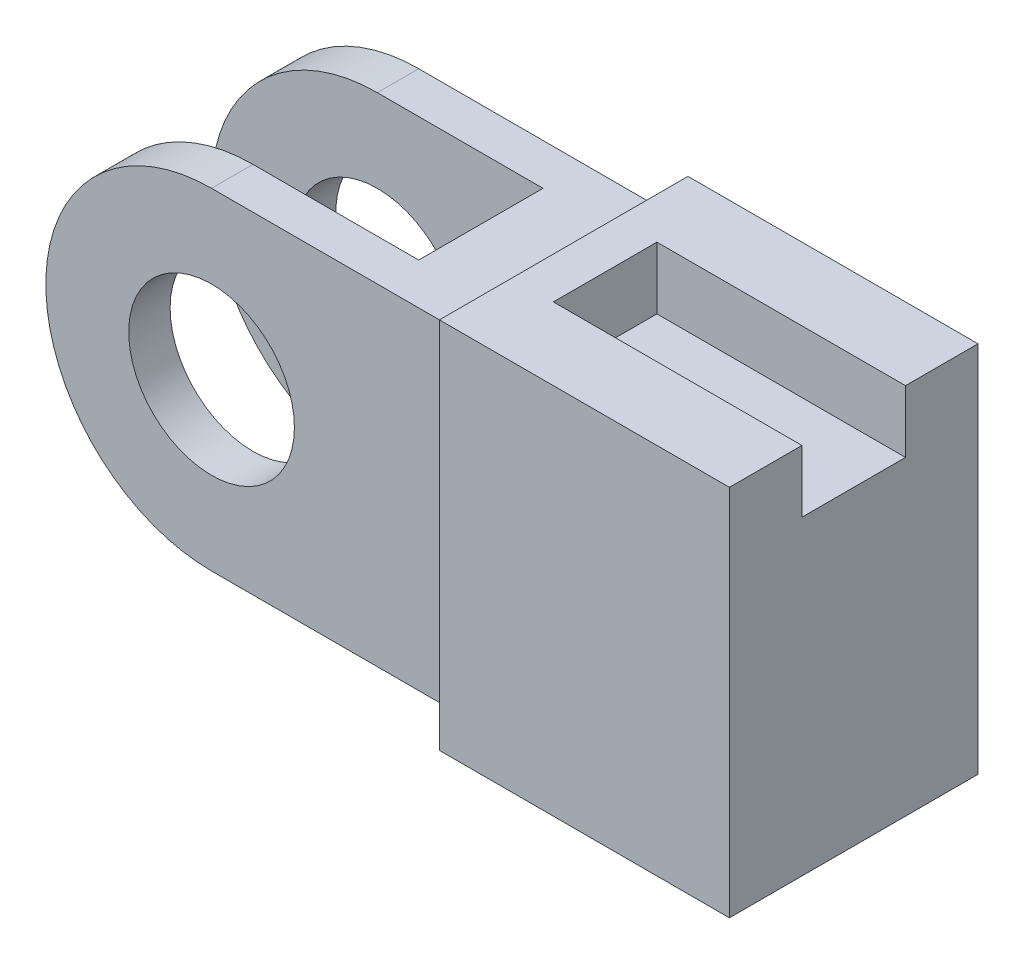
ISO-10303-21;
HEADER;
FILE_DESCRIPTION(('STEP AP214'),'2;1');
FILE_NAME('part.step','',(''),(''),'','','');
FILE_SCHEMA(('AUTOMOTIVE_DESIGN { 1 0 10303 214 1 1 1 1 }'));
ENDSEC;
DATA;
#1=APPLICATION_CONTEXT('core data for automotive mechanical design processes');
#2=APPLICATION_PROTOCOL_DEFINITION('international standard','automotive_design',2000,#1);
#3=PRODUCT_CONTEXT('',#1,'mechanical');
#4=PRODUCT('Part','Part','',(#3));
#5=PRODUCT_RELATED_PRODUCT_CATEGORY('part','',(#4));
#6=PRODUCT_DEFINITION_FORMATION('','',#4);
#7=PRODUCT_DEFINITION_CONTEXT('part definition',#1,'design');
#8=PRODUCT_DEFINITION('design','',#6,#7);
#9=PRODUCT_DEFINITION_SHAPE('','',#8);
#10=(LENGTH_UNIT() NAMED_UNIT(*) SI_UNIT(.MILLI.,.METRE.));
#11=(NAMED_UNIT(*) PLANE_ANGLE_UNIT() SI_UNIT($,.RADIAN.));
#12=(NAMED_UNIT(*) SI_UNIT($,.STERADIAN.) SOLID_ANGLE_UNIT());
#13=UNCERTAINTY_MEASURE_WITH_UNIT(LENGTH_MEASURE(1.E-05),#10,'distance_accuracy_value','');
#14=(GEOMETRIC_REPRESENTATION_CONTEXT(3) GLOBAL_UNCERTAINTY_ASSIGNED_CONTEXT((#13)) GLOBAL_UNIT_ASSIGNED_CONTEXT((#10,
#11,#12)) REPRESENTATION_CONTEXT('',''));
#15=CARTESIAN_POINT('',(0.,0.,0.));
#16=DIRECTION('',(0.,0.,1.));
#17=DIRECTION('',(1.,0.,0.));
#18=AXIS2_PLACEMENT_3D('',#15,#16,#17);
#19=CARTESIAN_POINT('',(-60.,40.,25.));
#20=DIRECTION('',(0.,0.,-1.));
#21=DIRECTION('',(-1.,0.,0.));
#22=AXIS2_PLACEMENT_3D('',#19,#20,#21);
#23=CYLINDRICAL_SURFACE('',#22,40.);
#24=CARTESIAN_POINT('',(-60.,40.,15.));
#25=DIRECTION('',(0.,0.,-1.));
#26=DIRECTION('',(-1.,0.,0.));
#27=AXIS2_PLACEMENT_3D('',#24,#25,#26);
#28=CIRCLE('',#27,40.);
#29=CARTESIAN_POINT('',(-60.,0.,15.));
#30=VERTEX_POINT('',#29);
#31=CARTESIAN_POINT('',(-60.,80.,15.));
#32=VERTEX_POINT('',#31);
#33=EDGE_CURVE('E254',#30,#32,#28,.T.);
#34=ORIENTED_EDGE('',*,*,#33,.F.);
#35=DIRECTION('',(0.,0.,-1.));
#36=VECTOR('',#35,1.);
#37=CARTESIAN_POINT('',(-60.,0.,25.));
#38=LINE('',#37,#36);
#39=CARTESIAN_POINT('',(-60.,0.,25.));
#40=VERTEX_POINT('',#39);
#41=EDGE_CURVE('E293',#40,#30,#38,.T.);
#42=ORIENTED_EDGE('',*,*,#41,.F.);
#43=CARTESIAN_POINT('',(-60.,40.,25.));
#44=DIRECTION('',(0.,0.,1.));
#45=DIRECTION('',(1.,0.,0.));
#46=AXIS2_PLACEMENT_3D('',#43,#44,#45);
#47=CIRCLE('',#46,40.);
#48=CARTESIAN_POINT('',(-60.,80.,25.));
#49=VERTEX_POINT('',#48);
#50=EDGE_CURVE('E268',#49,#40,#47,.T.);
#51=ORIENTED_EDGE('',*,*,#50,.F.);
#52=DIRECTION('',(0.,0.,-1.));
#53=VECTOR('',#52,1.);
#54=CARTESIAN_POINT('',(-60.,80.,25.));
#55=LINE('',#54,#53);
#56=EDGE_CURVE('E13',#49,#32,#55,.T.);
#57=ORIENTED_EDGE('',*,*,#56,.T.);
#58=EDGE_LOOP('',(#34,#42,#51,#57));
#59=FACE_BOUND('',#58,.T.);
#60=ADVANCED_FACE('F47',(#59),#23,.T.);
#61=CARTESIAN_POINT('',(-60.,40.,-25.));
#62=DIRECTION('',(0.,0.,1.));
#63=DIRECTION('',(1.,0.,0.));
#64=AXIS2_PLACEMENT_3D('',#61,#62,#63);
#65=CYLINDRICAL_SURFACE('',#64,20.);
#66=CARTESIAN_POINT('',(-60.,40.,25.));
#67=DIRECTION('',(0.,0.,1.));
#68=DIRECTION('',(1.,0.,0.));
#69=AXIS2_PLACEMENT_3D('',#66,#67,#68);
#70=CIRCLE('',#69,20.);
#71=CARTESIAN_POINT('',(-40.,40.,25.));
#72=VERTEX_POINT('',#71);
#73=EDGE_CURVE('E258',#72,#72,#70,.T.);
#74=ORIENTED_EDGE('',*,*,#73,.T.);
#75=EDGE_LOOP('',(#74));
#76=FACE_BOUND('',#75,.T.);
#77=CARTESIAN_POINT('',(-60.,40.,15.));
#78=DIRECTION('',(0.,0.,-1.));
#79=DIRECTION('',(-1.,0.,0.));
#80=AXIS2_PLACEMENT_3D('',#77,#78,#79);
#81=CIRCLE('',#80,20.);
#82=CARTESIAN_POINT('',(-80.,40.,15.));
#83=VERTEX_POINT('',#82);
#84=EDGE_CURVE('E251',#83,#83,#81,.F.);
#85=ORIENTED_EDGE('',*,*,#84,.F.);
#86=EDGE_LOOP('',(#85));
#87=FACE_BOUND('',#86,.T.);
#88=ADVANCED_FACE('F300',(#76,#87),#65,.F.);
#89=CARTESIAN_POINT('',(0.,80.,25.));
#90=DIRECTION('',(0.,-1.,0.));
#91=DIRECTION('',(1.,0.,0.));
#92=AXIS2_PLACEMENT_3D('',#89,#90,#91);
#93=PLANE('',#92);
#94=CARTESIAN_POINT('',(-60.,80.,-15.));
#95=VERTEX_POINT('',#94);
#96=CARTESIAN_POINT('',(-60.,80.,-25.));
#97=VERTEX_POINT('',#96);
#98=EDGE_CURVE('E56',#95,#97,#55,.T.);
#99=ORIENTED_EDGE('',*,*,#98,.F.);
#100=DIRECTION('',(-1.,0.,0.));
#101=VECTOR('',#100,1.);
#102=CARTESIAN_POINT('',(-20.,80.,-15.));
#103=LINE('',#102,#101);
#104=CARTESIAN_POINT('',(-20.,80.,-15.));
#105=VERTEX_POINT('',#104);
#106=EDGE_CURVE('E236',#105,#95,#103,.T.);
#107=ORIENTED_EDGE('',*,*,#106,.F.);
#108=DIRECTION('',(0.,0.,1.));
#109=VECTOR('',#108,1.);
#110=CARTESIAN_POINT('',(-20.,80.,-15.));
#111=LINE('',#110,#109);
#112=CARTESIAN_POINT('',(-20.,80.,15.));
#113=VERTEX_POINT('',#112);
#114=EDGE_CURVE('E242',#105,#113,#111,.T.);
#115=ORIENTED_EDGE('',*,*,#114,.T.);
#116=DIRECTION('',(-1.,0.,0.));
#117=VECTOR('',#116,1.);
#118=CARTESIAN_POINT('',(-20.,80.,15.));
#119=LINE('',#118,#117);
#120=EDGE_CURVE('E244',#113,#32,#119,.T.);
#121=ORIENTED_EDGE('',*,*,#120,.T.);
#122=ORIENTED_EDGE('',*,*,#56,.F.);
#123=DIRECTION('',(-1.,0.,0.));
#124=VECTOR('',#123,1.);
#125=CARTESIAN_POINT('',(0.,80.,25.));
#126=LINE('',#125,#124);
#127=CARTESIAN_POINT('',(0.,80.,25.));
#128=VERTEX_POINT('',#127);
#129=EDGE_CURVE('E265',#128,#49,#126,.T.);
#130=ORIENTED_EDGE('',*,*,#129,.F.);
#131=DIRECTION('',(0.,0.,-1.));
#132=VECTOR('',#131,1.);
#133=CARTESIAN_POINT('',(0.,80.,25.));
#134=LINE('',#133,#132);
#135=CARTESIAN_POINT('',(0.,80.,-25.));
#136=VERTEX_POINT('',#135);
#137=EDGE_CURVE('E276',#128,#136,#134,.T.);
#138=ORIENTED_EDGE('',*,*,#137,.T.);
#139=DIRECTION('',(-1.,0.,0.));
#140=VECTOR('',#139,1.);
#141=CARTESIAN_POINT('',(0.,80.,-25.));
#142=LINE('',#141,#140);
#143=EDGE_CURVE('E262',#136,#97,#142,.T.);
#144=ORIENTED_EDGE('',*,*,#143,.T.);
#145=EDGE_LOOP('',(#99,#107,#115,#121,#122,#130,#138,#144));
#146=FACE_BOUND('',#145,.T.);
#147=ADVANCED_FACE('F49',(#146),#93,.F.);
#148=CARTESIAN_POINT('',(-60.,40.,-15.));
#149=DIRECTION('',(0.,0.,-1.));
#150=DIRECTION('',(-1.,0.,0.));
#151=AXIS2_PLACEMENT_3D('',#148,#149,#150);
#152=CIRCLE('',#151,40.);
#153=CARTESIAN_POINT('',(-60.,0.,-15.));
#154=VERTEX_POINT('',#153);
#155=EDGE_CURVE('E256',#154,#95,#152,.T.);
#156=ORIENTED_EDGE('',*,*,#155,.T.);
#157=ORIENTED_EDGE('',*,*,#98,.T.);
#158=CARTESIAN_POINT('',(-60.,40.,-25.));
#159=DIRECTION('',(0.,0.,1.));
#160=DIRECTION('',(1.,0.,0.));
#161=AXIS2_PLACEMENT_3D('',#158,#159,#160);
#162=CIRCLE('',#161,40.);
#163=CARTESIAN_POINT('',(-60.,0.,-25.));
#164=VERTEX_POINT('',#163);
#165=EDGE_CURVE('E279',#97,#164,#162,.T.);
#166=ORIENTED_EDGE('',*,*,#165,.T.);
#167=EDGE_CURVE('E292',#154,#164,#38,.T.);
#168=ORIENTED_EDGE('',*,*,#167,.F.);
#169=EDGE_LOOP('',(#156,#157,#166,#168));
#170=FACE_BOUND('',#169,.T.);
#171=ADVANCED_FACE('F309',(#170),#23,.T.);
#172=CARTESIAN_POINT('',(0.,0.,25.));
#173=DIRECTION('',(0.,-1.,0.));
#174=DIRECTION('',(0.,0.,-1.));
#175=AXIS2_PLACEMENT_3D('',#172,#173,#174);
#176=PLANE('',#175);
#177=DIRECTION('',(1.,0.,0.));
#178=VECTOR('',#177,1.);
#179=CARTESIAN_POINT('',(-20.,0.,-15.));
#180=LINE('',#179,#178);
#181=CARTESIAN_POINT('',(-20.,0.,-15.));
#182=VERTEX_POINT('',#181);
#183=EDGE_CURVE('E240',#154,#182,#180,.T.);
#184=ORIENTED_EDGE('',*,*,#183,.F.);
#185=ORIENTED_EDGE('',*,*,#167,.T.);
#186=DIRECTION('',(-1.,0.,0.));
#187=VECTOR('',#186,1.);
#188=CARTESIAN_POINT('',(0.,0.,-25.));
#189=LINE('',#188,#187);
#190=CARTESIAN_POINT('',(0.,0.,-25.));
#191=VERTEX_POINT('',#190);
#192=EDGE_CURVE('E282',#191,#164,#189,.T.);
#193=ORIENTED_EDGE('',*,*,#192,.F.);
#194=DIRECTION('',(0.,0.,-1.));
#195=VECTOR('',#194,1.);
#196=CARTESIAN_POINT('',(0.,0.,25.));
#197=LINE('',#196,#195);
#198=CARTESIAN_POINT('',(0.,0.,25.));
#199=VERTEX_POINT('',#198);
#200=EDGE_CURVE('E289',#199,#191,#197,.T.);
#201=ORIENTED_EDGE('',*,*,#200,.F.);
#202=DIRECTION('',(-1.,0.,0.));
#203=VECTOR('',#202,1.);
#204=CARTESIAN_POINT('',(0.,0.,25.));
#205=LINE('',#204,#203);
#206=EDGE_CURVE('E271',#199,#40,#205,.T.);
#207=ORIENTED_EDGE('',*,*,#206,.T.);
#208=ORIENTED_EDGE('',*,*,#41,.T.);
#209=DIRECTION('',(1.,0.,0.));
#210=VECTOR('',#209,1.);
#211=CARTESIAN_POINT('',(-20.,0.,15.));
#212=LINE('',#211,#210);
#213=CARTESIAN_POINT('',(-20.,0.,15.));
#214=VERTEX_POINT('',#213);
#215=EDGE_CURVE('E237',#30,#214,#212,.T.);
#216=ORIENTED_EDGE('',*,*,#215,.T.);
#217=DIRECTION('',(0.,0.,1.));
#218=VECTOR('',#217,1.);
#219=CARTESIAN_POINT('',(-20.,0.,-15.));
#220=LINE('',#219,#218);
#221=EDGE_CURVE('E249',#182,#214,#220,.T.);
#222=ORIENTED_EDGE('',*,*,#221,.F.);
#223=EDGE_LOOP('',(#184,#185,#193,#201,#207,#208,#216,#222));
#224=FACE_BOUND('',#223,.T.);
#225=ADVANCED_FACE('F345',(#224),#176,.T.);
#226=CARTESIAN_POINT('',(0.,0.,25.));
#227=DIRECTION('',(0.,0.,1.));
#228=DIRECTION('',(1.,0.,0.));
#229=AXIS2_PLACEMENT_3D('',#226,#227,#228);
#230=PLANE('',#229);
#231=ORIENTED_EDGE('',*,*,#73,.F.);
#232=EDGE_LOOP('',(#231));
#233=FACE_BOUND('',#232,.T.);
#234=ORIENTED_EDGE('',*,*,#129,.T.);
#235=ORIENTED_EDGE('',*,*,#50,.T.);
#236=ORIENTED_EDGE('',*,*,#206,.F.);
#237=DIRECTION('',(0.,1.,0.));
#238=VECTOR('',#237,1.);
#239=CARTESIAN_POINT('',(0.,0.,25.));
#240=LINE('',#239,#238);
#241=EDGE_CURVE('E274',#199,#128,#240,.T.);
#242=ORIENTED_EDGE('',*,*,#241,.T.);
#243=EDGE_LOOP('',(#234,#235,#236,#242));
#244=FACE_BOUND('',#243,.T.);
#245=ADVANCED_FACE('F324',(#233,#244),#230,.T.);
#246=CARTESIAN_POINT('',(0.,0.,-25.));
#247=DIRECTION('',(0.,0.,1.));
#248=DIRECTION('',(1.,0.,0.));
#249=AXIS2_PLACEMENT_3D('',#246,#247,#248);
#250=PLANE('',#249);
#251=CARTESIAN_POINT('',(-60.,40.,-25.));
#252=DIRECTION('',(0.,0.,1.));
#253=DIRECTION('',(1.,0.,0.));
#254=AXIS2_PLACEMENT_3D('',#251,#252,#253);
#255=CIRCLE('',#254,20.);
#256=CARTESIAN_POINT('',(-40.,40.,-25.));
#257=VERTEX_POINT('',#256);
#258=EDGE_CURVE('E259',#257,#257,#255,.T.);
#259=ORIENTED_EDGE('',*,*,#258,.T.);
#260=EDGE_LOOP('',(#259));
#261=FACE_BOUND('',#260,.T.);
#262=ORIENTED_EDGE('',*,*,#143,.F.);
#263=DIRECTION('',(0.,1.,0.));
#264=VECTOR('',#263,1.);
#265=CARTESIAN_POINT('',(0.,0.,-25.));
#266=LINE('',#265,#264);
#267=EDGE_CURVE('E269',#191,#136,#266,.T.);
#268=ORIENTED_EDGE('',*,*,#267,.F.);
#269=ORIENTED_EDGE('',*,*,#192,.T.);
#270=ORIENTED_EDGE('',*,*,#165,.F.);
#271=EDGE_LOOP('',(#262,#268,#269,#270));
#272=FACE_BOUND('',#271,.T.);
#273=ADVANCED_FACE('F316',(#261,#272),#250,.F.);
#274=CARTESIAN_POINT('',(-60.,40.,-15.));
#275=DIRECTION('',(0.,0.,-1.));
#276=DIRECTION('',(-1.,0.,0.));
#277=AXIS2_PLACEMENT_3D('',#274,#275,#276);
#278=CIRCLE('',#277,20.);
#279=CARTESIAN_POINT('',(-80.,40.,-15.));
#280=VERTEX_POINT('',#279);
#281=EDGE_CURVE('E51',#280,#280,#278,.F.);
#282=ORIENTED_EDGE('',*,*,#281,.T.);
#283=EDGE_LOOP('',(#282));
#284=FACE_BOUND('',#283,.T.);
#285=ORIENTED_EDGE('',*,*,#258,.F.);
#286=EDGE_LOOP('',(#285));
#287=FACE_BOUND('',#286,.T.);
#288=ADVANCED_FACE('F304',(#284,#287),#65,.F.);
#289=CARTESIAN_POINT('',(0.,0.,-15.));
#290=DIRECTION('',(0.,0.,-1.));
#291=DIRECTION('',(-1.,0.,0.));
#292=AXIS2_PLACEMENT_3D('',#289,#290,#291);
#293=PLANE('',#292);
#294=ORIENTED_EDGE('',*,*,#281,.F.);
#295=EDGE_LOOP('',(#294));
#296=FACE_BOUND('',#295,.T.);
#297=ORIENTED_EDGE('',*,*,#155,.F.);
#298=ORIENTED_EDGE('',*,*,#183,.T.);
#299=DIRECTION('',(0.,1.,0.));
#300=VECTOR('',#299,1.);
#301=CARTESIAN_POINT('',(-20.,80.,-15.));
#302=LINE('',#301,#300);
#303=EDGE_CURVE('E233',#182,#105,#302,.T.);
#304=ORIENTED_EDGE('',*,*,#303,.T.);
#305=ORIENTED_EDGE('',*,*,#106,.T.);
#306=EDGE_LOOP('',(#297,#298,#304,#305));
#307=FACE_BOUND('',#306,.T.);
#308=ADVANCED_FACE('F315',(#296,#307),#293,.F.);
#309=CARTESIAN_POINT('',(0.,0.,15.));
#310=DIRECTION('',(0.,0.,-1.));
#311=DIRECTION('',(-1.,0.,0.));
#312=AXIS2_PLACEMENT_3D('',#309,#310,#311);
#313=PLANE('',#312);
#314=ORIENTED_EDGE('',*,*,#84,.T.);
#315=EDGE_LOOP('',(#314));
#316=FACE_BOUND('',#315,.T.);
#317=ORIENTED_EDGE('',*,*,#33,.T.);
#318=ORIENTED_EDGE('',*,*,#120,.F.);
#319=DIRECTION('',(0.,1.,0.));
#320=VECTOR('',#319,1.);
#321=CARTESIAN_POINT('',(-20.,80.,15.));
#322=LINE('',#321,#320);
#323=EDGE_CURVE('E72',#214,#113,#322,.T.);
#324=ORIENTED_EDGE('',*,*,#323,.F.);
#325=ORIENTED_EDGE('',*,*,#215,.F.);
#326=EDGE_LOOP('',(#317,#318,#324,#325));
#327=FACE_BOUND('',#326,.T.);
#328=ADVANCED_FACE('F298',(#316,#327),#313,.T.);
#329=CARTESIAN_POINT('',(-20.,80.,-15.));
#330=DIRECTION('',(1.,0.,0.));
#331=DIRECTION('',(0.,1.,0.));
#332=AXIS2_PLACEMENT_3D('',#329,#330,#331);
#333=PLANE('',#332);
#334=ORIENTED_EDGE('',*,*,#323,.T.);
#335=ORIENTED_EDGE('',*,*,#114,.F.);
#336=ORIENTED_EDGE('',*,*,#303,.F.);
#337=ORIENTED_EDGE('',*,*,#221,.T.);
#338=EDGE_LOOP('',(#334,#335,#336,#337));
#339=FACE_BOUND('',#338,.T.);
#340=ADVANCED_FACE('F352',(#339),#333,.F.);
#341=CARTESIAN_POINT('',(70.,-5.,30.));
#342=DIRECTION('',(0.,1.,0.));
#343=DIRECTION('',(0.,0.,1.));
#344=AXIS2_PLACEMENT_3D('',#341,#342,#343);
#345=PLANE('',#344);
#346=DIRECTION('',(0.,0.,-1.));
#347=VECTOR('',#346,1.);
#348=CARTESIAN_POINT('',(0.,-5.,30.));
#349=LINE('',#348,#347);
#350=CARTESIAN_POINT('',(0.,-5.,30.));
#351=VERTEX_POINT('',#350);
#352=CARTESIAN_POINT('',(0.,-5.,-30.));
#353=VERTEX_POINT('',#352);
#354=EDGE_CURVE('E199',#351,#353,#349,.T.);
#355=ORIENTED_EDGE('',*,*,#354,.T.);
#356=DIRECTION('',(-1.,0.,0.));
#357=VECTOR('',#356,1.);
#358=CARTESIAN_POINT('',(70.,-5.,-30.));
#359=LINE('',#358,#357);
#360=CARTESIAN_POINT('',(70.,-5.,-30.));
#361=VERTEX_POINT('',#360);
#362=EDGE_CURVE('E230',#361,#353,#359,.T.);
#363=ORIENTED_EDGE('',*,*,#362,.F.);
#364=DIRECTION('',(0.,0.,-1.));
#365=VECTOR('',#364,1.);
#366=CARTESIAN_POINT('',(70.,-5.,30.));
#367=LINE('',#366,#365);
#368=CARTESIAN_POINT('',(70.,-5.,30.));
#369=VERTEX_POINT('',#368);
#370=EDGE_CURVE('E203',#369,#361,#367,.T.);
#371=ORIENTED_EDGE('',*,*,#370,.F.);
#372=DIRECTION('',(-1.,0.,0.));
#373=VECTOR('',#372,1.);
#374=CARTESIAN_POINT('',(70.,-5.,30.));
#375=LINE('',#374,#373);
#376=EDGE_CURVE('E214',#369,#351,#375,.T.);
#377=ORIENTED_EDGE('',*,*,#376,.T.);
#378=EDGE_LOOP('',(#355,#363,#371,#377));
#379=FACE_BOUND('',#378,.T.);
#380=ADVANCED_FACE('F378',(#379),#345,.F.);
#381=CARTESIAN_POINT('',(70.,-5.,-30.));
#382=DIRECTION('',(0.,0.,1.));
#383=DIRECTION('',(1.,0.,0.));
#384=AXIS2_PLACEMENT_3D('',#381,#382,#383);
#385=PLANE('',#384);
#386=DIRECTION('',(0.,1.,0.));
#387=VECTOR('',#386,1.);
#388=CARTESIAN_POINT('',(0.,-5.,-30.));
#389=LINE('',#388,#387);
#390=CARTESIAN_POINT('',(0.,85.,-30.));
#391=VERTEX_POINT('',#390);
#392=EDGE_CURVE('E217',#353,#391,#389,.T.);
#393=ORIENTED_EDGE('',*,*,#392,.T.);
#394=DIRECTION('',(-1.,0.,0.));
#395=VECTOR('',#394,1.);
#396=CARTESIAN_POINT('',(70.,85.,-30.));
#397=LINE('',#396,#395);
#398=CARTESIAN_POINT('',(70.,85.,-30.));
#399=VERTEX_POINT('',#398);
#400=EDGE_CURVE('E227',#399,#391,#397,.T.);
#401=ORIENTED_EDGE('',*,*,#400,.F.);
#402=DIRECTION('',(0.,1.,0.));
#403=VECTOR('',#402,1.);
#404=CARTESIAN_POINT('',(70.,-5.,-30.));
#405=LINE('',#404,#403);
#406=EDGE_CURVE('E206',#361,#399,#405,.T.);
#407=ORIENTED_EDGE('',*,*,#406,.F.);
#408=ORIENTED_EDGE('',*,*,#362,.T.);
#409=EDGE_LOOP('',(#393,#401,#407,#408));
#410=FACE_BOUND('',#409,.T.);
#411=ADVANCED_FACE('F383',(#410),#385,.F.);
#412=CARTESIAN_POINT('',(70.,85.,-30.));
#413=DIRECTION('',(0.,-1.,0.));
#414=DIRECTION('',(0.,0.,-1.));
#415=AXIS2_PLACEMENT_3D('',#412,#413,#414);
#416=PLANE('',#415);
#417=DIRECTION('',(0.,0.,1.));
#418=VECTOR('',#417,1.);
#419=CARTESIAN_POINT('',(10.,85.,-12.5));
#420=LINE('',#419,#418);
#421=CARTESIAN_POINT('',(10.,85.,-12.5));
#422=VERTEX_POINT('',#421);
#423=CARTESIAN_POINT('',(10.,85.,12.5));
#424=VERTEX_POINT('',#423);
#425=EDGE_CURVE('E181',#422,#424,#420,.T.);
#426=ORIENTED_EDGE('',*,*,#425,.F.);
#427=DIRECTION('',(1.,0.,0.));
#428=VECTOR('',#427,1.);
#429=CARTESIAN_POINT('',(10.,85.,-12.5));
#430=LINE('',#429,#428);
#431=CARTESIAN_POINT('',(70.,85.,-12.5));
#432=VERTEX_POINT('',#431);
#433=EDGE_CURVE('E164',#422,#432,#430,.T.);
#434=ORIENTED_EDGE('',*,*,#433,.T.);
#435=DIRECTION('',(0.,0.,1.));
#436=VECTOR('',#435,1.);
#437=CARTESIAN_POINT('',(70.,85.,-30.));
#438=LINE('',#437,#436);
#439=EDGE_CURVE('E210',#399,#432,#438,.T.);
#440=ORIENTED_EDGE('',*,*,#439,.F.);
#441=ORIENTED_EDGE('',*,*,#400,.T.);
#442=DIRECTION('',(0.,0.,1.));
#443=VECTOR('',#442,1.);
#444=CARTESIAN_POINT('',(0.,85.,-30.));
#445=LINE('',#444,#443);
#446=CARTESIAN_POINT('',(0.,85.,30.));
#447=VERTEX_POINT('',#446);
#448=EDGE_CURVE('E219',#391,#447,#445,.T.);
#449=ORIENTED_EDGE('',*,*,#448,.T.);
#450=DIRECTION('',(-1.,0.,0.));
#451=VECTOR('',#450,1.);
#452=CARTESIAN_POINT('',(70.,85.,30.));
#453=LINE('',#452,#451);
#454=CARTESIAN_POINT('',(70.,85.,30.));
#455=VERTEX_POINT('',#454);
#456=EDGE_CURVE('E224',#455,#447,#453,.T.);
#457=ORIENTED_EDGE('',*,*,#456,.F.);
#458=CARTESIAN_POINT('',(70.,85.,12.5));
#459=VERTEX_POINT('',#458);
#460=EDGE_CURVE('E209',#459,#455,#438,.T.);
#461=ORIENTED_EDGE('',*,*,#460,.F.);
#462=DIRECTION('',(1.,0.,0.));
#463=VECTOR('',#462,1.);
#464=CARTESIAN_POINT('',(10.,85.,12.5));
#465=LINE('',#464,#463);
#466=EDGE_CURVE('E64',#424,#459,#465,.T.);
#467=ORIENTED_EDGE('',*,*,#466,.F.);
#468=EDGE_LOOP('',(#426,#434,#440,#441,#449,#457,#461,#467));
#469=FACE_BOUND('',#468,.T.);
#470=ADVANCED_FACE('F185',(#469),#416,.F.);
#471=CARTESIAN_POINT('',(70.,85.,30.));
#472=DIRECTION('',(0.,0.,-1.));
#473=DIRECTION('',(-1.,0.,0.));
#474=AXIS2_PLACEMENT_3D('',#471,#472,#473);
#475=PLANE('',#474);
#476=DIRECTION('',(0.,-1.,0.));
#477=VECTOR('',#476,1.);
#478=CARTESIAN_POINT('',(0.,85.,30.));
#479=LINE('',#478,#477);
#480=EDGE_CURVE('E207',#447,#351,#479,.T.);
#481=ORIENTED_EDGE('',*,*,#480,.T.);
#482=ORIENTED_EDGE('',*,*,#376,.F.);
#483=DIRECTION('',(0.,-1.,0.));
#484=VECTOR('',#483,1.);
#485=CARTESIAN_POINT('',(70.,85.,30.));
#486=LINE('',#485,#484);
#487=EDGE_CURVE('E212',#455,#369,#486,.T.);
#488=ORIENTED_EDGE('',*,*,#487,.F.);
#489=ORIENTED_EDGE('',*,*,#456,.T.);
#490=EDGE_LOOP('',(#481,#482,#488,#489));
#491=FACE_BOUND('',#490,.T.);
#492=ADVANCED_FACE('F402',(#491),#475,.F.);
#493=CARTESIAN_POINT('',(70.,0.,0.));
#494=DIRECTION('',(1.,0.,0.));
#495=DIRECTION('',(0.,0.,-1.));
#496=AXIS2_PLACEMENT_3D('',#493,#494,#495);
#497=PLANE('',#496);
#498=DIRECTION('',(0.,1.,0.));
#499=VECTOR('',#498,1.);
#500=CARTESIAN_POINT('',(70.,85.,-12.5));
#501=LINE('',#500,#499);
#502=CARTESIAN_POINT('',(70.,70.,-12.5));
#503=VERTEX_POINT('',#502);
#504=EDGE_CURVE('E170',#503,#432,#501,.T.);
#505=ORIENTED_EDGE('',*,*,#504,.F.);
#506=DIRECTION('',(0.,0.,-1.));
#507=VECTOR('',#506,1.);
#508=CARTESIAN_POINT('',(70.,70.,-12.5));
#509=LINE('',#508,#507);
#510=CARTESIAN_POINT('',(70.,70.,12.5));
#511=VERTEX_POINT('',#510);
#512=EDGE_CURVE('E183',#511,#503,#509,.T.);
#513=ORIENTED_EDGE('',*,*,#512,.F.);
#514=DIRECTION('',(0.,-1.,0.));
#515=VECTOR('',#514,1.);
#516=CARTESIAN_POINT('',(70.,85.,12.5));
#517=LINE('',#516,#515);
#518=EDGE_CURVE('E193',#459,#511,#517,.T.);
#519=ORIENTED_EDGE('',*,*,#518,.F.);
#520=ORIENTED_EDGE('',*,*,#460,.T.);
#521=ORIENTED_EDGE('',*,*,#487,.T.);
#522=ORIENTED_EDGE('',*,*,#370,.T.);
#523=ORIENTED_EDGE('',*,*,#406,.T.);
#524=ORIENTED_EDGE('',*,*,#439,.T.);
#525=EDGE_LOOP('',(#505,#513,#519,#520,#521,#522,#523,#524));
#526=FACE_BOUND('',#525,.T.);
#527=ADVANCED_FACE('F407',(#526),#497,.T.);
#528=CARTESIAN_POINT('',(0.,0.,0.));
#529=DIRECTION('',(1.,0.,0.));
#530=DIRECTION('',(0.,0.,-1.));
#531=AXIS2_PLACEMENT_3D('',#528,#529,#530);
#532=PLANE('',#531);
#533=ORIENTED_EDGE('',*,*,#241,.F.);
#534=ORIENTED_EDGE('',*,*,#200,.T.);
#535=ORIENTED_EDGE('',*,*,#267,.T.);
#536=ORIENTED_EDGE('',*,*,#137,.F.);
#537=EDGE_LOOP('',(#533,#534,#535,#536));
#538=FACE_BOUND('',#537,.T.);
#539=ORIENTED_EDGE('',*,*,#354,.F.);
#540=ORIENTED_EDGE('',*,*,#480,.F.);
#541=ORIENTED_EDGE('',*,*,#448,.F.);
#542=ORIENTED_EDGE('',*,*,#392,.F.);
#543=EDGE_LOOP('',(#539,#540,#541,#542));
#544=FACE_BOUND('',#543,.T.);
#545=ADVANCED_FACE('F340',(#538,#544),#532,.F.);
#546=CARTESIAN_POINT('',(10.,85.,-12.5));
#547=DIRECTION('',(0.,0.,-1.));
#548=DIRECTION('',(-1.,0.,0.));
#549=AXIS2_PLACEMENT_3D('',#546,#547,#548);
#550=PLANE('',#549);
#551=ORIENTED_EDGE('',*,*,#504,.T.);
#552=ORIENTED_EDGE('',*,*,#433,.F.);
#553=DIRECTION('',(0.,1.,0.));
#554=VECTOR('',#553,1.);
#555=CARTESIAN_POINT('',(10.,85.,-12.5));
#556=LINE('',#555,#554);
#557=CARTESIAN_POINT('',(10.,70.,-12.5));
#558=VERTEX_POINT('',#557);
#559=EDGE_CURVE('E167',#558,#422,#556,.T.);
#560=ORIENTED_EDGE('',*,*,#559,.F.);
#561=DIRECTION('',(1.,0.,0.));
#562=VECTOR('',#561,1.);
#563=CARTESIAN_POINT('',(10.,70.,-12.5));
#564=LINE('',#563,#562);
#565=EDGE_CURVE('E197',#558,#503,#564,.T.);
#566=ORIENTED_EDGE('',*,*,#565,.T.);
#567=EDGE_LOOP('',(#551,#552,#560,#566));
#568=FACE_BOUND('',#567,.T.);
#569=ADVANCED_FACE('F166',(#568),#550,.F.);
#570=CARTESIAN_POINT('',(10.,70.,-12.5));
#571=DIRECTION('',(0.,-1.,0.));
#572=DIRECTION('',(0.,0.,-1.));
#573=AXIS2_PLACEMENT_3D('',#570,#571,#572);
#574=PLANE('',#573);
#575=ORIENTED_EDGE('',*,*,#512,.T.);
#576=ORIENTED_EDGE('',*,*,#565,.F.);
#577=DIRECTION('',(0.,0.,-1.));
#578=VECTOR('',#577,1.);
#579=CARTESIAN_POINT('',(10.,70.,-12.5));
#580=LINE('',#579,#578);
#581=CARTESIAN_POINT('',(10.,70.,12.5));
#582=VERTEX_POINT('',#581);
#583=EDGE_CURVE('E175',#582,#558,#580,.T.);
#584=ORIENTED_EDGE('',*,*,#583,.F.);
#585=DIRECTION('',(1.,0.,0.));
#586=VECTOR('',#585,1.);
#587=CARTESIAN_POINT('',(10.,70.,12.5));
#588=LINE('',#587,#586);
#589=EDGE_CURVE('E200',#582,#511,#588,.T.);
#590=ORIENTED_EDGE('',*,*,#589,.T.);
#591=EDGE_LOOP('',(#575,#576,#584,#590));
#592=FACE_BOUND('',#591,.T.);
#593=ADVANCED_FACE('F440',(#592),#574,.F.);
#594=CARTESIAN_POINT('',(10.,85.,12.5));
#595=DIRECTION('',(0.,0.,1.));
#596=DIRECTION('',(1.,0.,0.));
#597=AXIS2_PLACEMENT_3D('',#594,#595,#596);
#598=PLANE('',#597);
#599=ORIENTED_EDGE('',*,*,#518,.T.);
#600=ORIENTED_EDGE('',*,*,#589,.F.);
#601=DIRECTION('',(0.,-1.,0.));
#602=VECTOR('',#601,1.);
#603=CARTESIAN_POINT('',(10.,85.,12.5));
#604=LINE('',#603,#602);
#605=EDGE_CURVE('E187',#424,#582,#604,.T.);
#606=ORIENTED_EDGE('',*,*,#605,.F.);
#607=ORIENTED_EDGE('',*,*,#466,.T.);
#608=EDGE_LOOP('',(#599,#600,#606,#607));
#609=FACE_BOUND('',#608,.T.);
#610=ADVANCED_FACE('F449',(#609),#598,.F.);
#611=CARTESIAN_POINT('',(10.,0.,0.));
#612=DIRECTION('',(-1.,0.,0.));
#613=DIRECTION('',(0.,0.,1.));
#614=AXIS2_PLACEMENT_3D('',#611,#612,#613);
#615=PLANE('',#614);
#616=ORIENTED_EDGE('',*,*,#559,.T.);
#617=ORIENTED_EDGE('',*,*,#425,.T.);
#618=ORIENTED_EDGE('',*,*,#605,.T.);
#619=ORIENTED_EDGE('',*,*,#583,.T.);
#620=EDGE_LOOP('',(#616,#617,#618,#619));
#621=FACE_BOUND('',#620,.T.);
#622=ADVANCED_FACE('F179',(#621),#615,.F.);
#623=CLOSED_SHELL('',(#60,#88,#147,#171,#225,#245,#273,#288,#308,#328,#340,#380,#411,#470,#492,
#527,#545,#569,#593,#610,#622));
#624=MANIFOLD_SOLID_BREP('B2',#623);
#625=ADVANCED_BREP_SHAPE_REPRESENTATION('',(#18,#624),#14);
#626=SHAPE_DEFINITION_REPRESENTATION(#9,#625);
ENDSEC;
END-ISO-10303-21;
